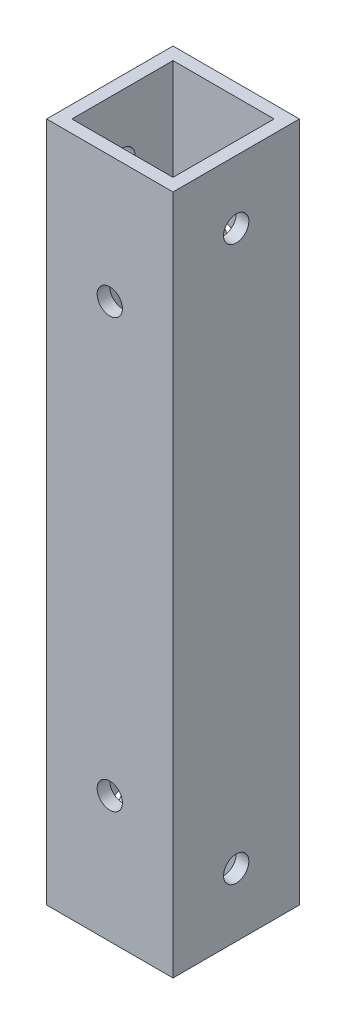
ISO-10303-21;
HEADER;
FILE_DESCRIPTION(('STEP AP214'),'2;1');
FILE_NAME('part.step','',(''),(''),'','','');
FILE_SCHEMA(('AUTOMOTIVE_DESIGN { 1 0 10303 214 1 1 1 1 }'));
ENDSEC;
DATA;
#1=APPLICATION_CONTEXT('core data for automotive mechanical design processes');
#2=APPLICATION_PROTOCOL_DEFINITION('international standard','automotive_design',2000,#1);
#3=PRODUCT_CONTEXT('',#1,'mechanical');
#4=PRODUCT('Part','Part','',(#3));
#5=PRODUCT_RELATED_PRODUCT_CATEGORY('part','',(#4));
#6=PRODUCT_DEFINITION_FORMATION('','',#4);
#7=PRODUCT_DEFINITION_CONTEXT('part definition',#1,'design');
#8=PRODUCT_DEFINITION('design','',#6,#7);
#9=PRODUCT_DEFINITION_SHAPE('','',#8);
#10=(LENGTH_UNIT() NAMED_UNIT(*) SI_UNIT(.MILLI.,.METRE.));
#11=(NAMED_UNIT(*) PLANE_ANGLE_UNIT() SI_UNIT($,.RADIAN.));
#12=(NAMED_UNIT(*) SI_UNIT($,.STERADIAN.) SOLID_ANGLE_UNIT());
#13=UNCERTAINTY_MEASURE_WITH_UNIT(LENGTH_MEASURE(1.E-05),#10,'distance_accuracy_value','');
#14=(GEOMETRIC_REPRESENTATION_CONTEXT(3) GLOBAL_UNCERTAINTY_ASSIGNED_CONTEXT((#13)) GLOBAL_UNIT_ASSIGNED_CONTEXT((#10,
#11,#12)) REPRESENTATION_CONTEXT('',''));
#15=CARTESIAN_POINT('',(0.,0.,0.));
#16=DIRECTION('',(0.,0.,1.));
#17=DIRECTION('',(1.,0.,0.));
#18=AXIS2_PLACEMENT_3D('',#15,#16,#17);
#19=CARTESIAN_POINT('',(0.,80.79,0.));
#20=DIRECTION('',(0.,1.,0.));
#21=DIRECTION('',(0.,0.,1.));
#22=AXIS2_PLACEMENT_3D('',#19,#20,#21);
#23=PLANE('',#22);
#24=DIRECTION('',(0.,0.,1.));
#25=VECTOR('',#24,1.);
#26=CARTESIAN_POINT('',(0.,80.79,0.));
#27=LINE('',#26,#25);
#28=CARTESIAN_POINT('',(0.,80.79,-15.));
#29=VERTEX_POINT('',#28);
#30=CARTESIAN_POINT('',(0.,80.79,0.));
#31=VERTEX_POINT('',#30);
#32=EDGE_CURVE('E186',#29,#31,#27,.T.);
#33=ORIENTED_EDGE('',*,*,#32,.T.);
#34=DIRECTION('',(1.,0.,0.));
#35=VECTOR('',#34,1.);
#36=CARTESIAN_POINT('',(0.,80.79,0.));
#37=LINE('',#36,#35);
#38=CARTESIAN_POINT('',(15.,80.79,0.));
#39=VERTEX_POINT('',#38);
#40=EDGE_CURVE('E190',#31,#39,#37,.T.);
#41=ORIENTED_EDGE('',*,*,#40,.T.);
#42=DIRECTION('',(0.,0.,-1.));
#43=VECTOR('',#42,1.);
#44=CARTESIAN_POINT('',(15.,80.79,0.));
#45=LINE('',#44,#43);
#46=CARTESIAN_POINT('',(15.,80.79,-15.));
#47=VERTEX_POINT('',#46);
#48=EDGE_CURVE('E194',#39,#47,#45,.T.);
#49=ORIENTED_EDGE('',*,*,#48,.T.);
#50=DIRECTION('',(-1.,0.,0.));
#51=VECTOR('',#50,1.);
#52=CARTESIAN_POINT('',(0.,80.79,-15.));
#53=LINE('',#52,#51);
#54=EDGE_CURVE('E197',#47,#29,#53,.T.);
#55=ORIENTED_EDGE('',*,*,#54,.T.);
#56=EDGE_LOOP('',(#33,#41,#49,#55));
#57=FACE_BOUND('',#56,.T.);
#58=DIRECTION('',(1.,0.,0.));
#59=VECTOR('',#58,1.);
#60=CARTESIAN_POINT('',(0.,80.79,-1.5));
#61=LINE('',#60,#59);
#62=CARTESIAN_POINT('',(1.5,80.79,-1.5));
#63=VERTEX_POINT('',#62);
#64=CARTESIAN_POINT('',(13.5,80.79,-1.5));
#65=VERTEX_POINT('',#64);
#66=EDGE_CURVE('E145',#63,#65,#61,.T.);
#67=ORIENTED_EDGE('',*,*,#66,.F.);
#68=DIRECTION('',(0.,0.,1.));
#69=VECTOR('',#68,1.);
#70=CARTESIAN_POINT('',(1.5,80.79,0.));
#71=LINE('',#70,#69);
#72=CARTESIAN_POINT('',(1.5,80.79,-13.5));
#73=VERTEX_POINT('',#72);
#74=EDGE_CURVE('E136',#73,#63,#71,.T.);
#75=ORIENTED_EDGE('',*,*,#74,.F.);
#76=DIRECTION('',(-1.,0.,0.));
#77=VECTOR('',#76,1.);
#78=CARTESIAN_POINT('',(0.,80.79,-13.5));
#79=LINE('',#78,#77);
#80=CARTESIAN_POINT('',(13.5,80.79,-13.5));
#81=VERTEX_POINT('',#80);
#82=EDGE_CURVE('E162',#81,#73,#79,.T.);
#83=ORIENTED_EDGE('',*,*,#82,.F.);
#84=DIRECTION('',(0.,0.,-1.));
#85=VECTOR('',#84,1.);
#86=CARTESIAN_POINT('',(13.5,80.79,0.));
#87=LINE('',#86,#85);
#88=EDGE_CURVE('E158',#65,#81,#87,.T.);
#89=ORIENTED_EDGE('',*,*,#88,.F.);
#90=EDGE_LOOP('',(#67,#75,#83,#89));
#91=FACE_BOUND('',#90,.T.);
#92=ADVANCED_FACE('F68',(#57,#91),#23,.T.);
#93=CARTESIAN_POINT('',(0.,0.,0.));
#94=DIRECTION('',(0.,1.,0.));
#95=DIRECTION('',(0.,0.,1.));
#96=AXIS2_PLACEMENT_3D('',#93,#94,#95);
#97=PLANE('',#96);
#98=DIRECTION('',(0.,0.,1.));
#99=VECTOR('',#98,1.);
#100=CARTESIAN_POINT('',(0.,0.,0.));
#101=LINE('',#100,#99);
#102=CARTESIAN_POINT('',(0.,0.,-15.));
#103=VERTEX_POINT('',#102);
#104=CARTESIAN_POINT('',(0.,0.,0.));
#105=VERTEX_POINT('',#104);
#106=EDGE_CURVE('E154',#103,#105,#101,.T.);
#107=ORIENTED_EDGE('',*,*,#106,.F.);
#108=DIRECTION('',(-1.,0.,0.));
#109=VECTOR('',#108,1.);
#110=CARTESIAN_POINT('',(0.,0.,-15.));
#111=LINE('',#110,#109);
#112=CARTESIAN_POINT('',(15.,0.,-15.));
#113=VERTEX_POINT('',#112);
#114=EDGE_CURVE('E191',#113,#103,#111,.T.);
#115=ORIENTED_EDGE('',*,*,#114,.F.);
#116=DIRECTION('',(0.,0.,-1.));
#117=VECTOR('',#116,1.);
#118=CARTESIAN_POINT('',(15.,0.,0.));
#119=LINE('',#118,#117);
#120=CARTESIAN_POINT('',(15.,0.,0.));
#121=VERTEX_POINT('',#120);
#122=EDGE_CURVE('E207',#121,#113,#119,.T.);
#123=ORIENTED_EDGE('',*,*,#122,.F.);
#124=DIRECTION('',(1.,0.,0.));
#125=VECTOR('',#124,1.);
#126=CARTESIAN_POINT('',(0.,0.,0.));
#127=LINE('',#126,#125);
#128=EDGE_CURVE('E204',#105,#121,#127,.T.);
#129=ORIENTED_EDGE('',*,*,#128,.F.);
#130=EDGE_LOOP('',(#107,#115,#123,#129));
#131=FACE_BOUND('',#130,.T.);
#132=DIRECTION('',(0.,0.,1.));
#133=VECTOR('',#132,1.);
#134=CARTESIAN_POINT('',(1.5,0.,0.));
#135=LINE('',#134,#133);
#136=CARTESIAN_POINT('',(1.5,0.,-13.5));
#137=VERTEX_POINT('',#136);
#138=CARTESIAN_POINT('',(1.5,0.,-1.5));
#139=VERTEX_POINT('',#138);
#140=EDGE_CURVE('E94',#137,#139,#135,.T.);
#141=ORIENTED_EDGE('',*,*,#140,.T.);
#142=DIRECTION('',(1.,0.,0.));
#143=VECTOR('',#142,1.);
#144=CARTESIAN_POINT('',(0.,0.,-1.5));
#145=LINE('',#144,#143);
#146=CARTESIAN_POINT('',(13.5,0.,-1.5));
#147=VERTEX_POINT('',#146);
#148=EDGE_CURVE('E152',#139,#147,#145,.T.);
#149=ORIENTED_EDGE('',*,*,#148,.T.);
#150=DIRECTION('',(0.,0.,-1.));
#151=VECTOR('',#150,1.);
#152=CARTESIAN_POINT('',(13.5,0.,0.));
#153=LINE('',#152,#151);
#154=CARTESIAN_POINT('',(13.5,0.,-13.5));
#155=VERTEX_POINT('',#154);
#156=EDGE_CURVE('E173',#147,#155,#153,.T.);
#157=ORIENTED_EDGE('',*,*,#156,.T.);
#158=DIRECTION('',(-1.,0.,0.));
#159=VECTOR('',#158,1.);
#160=CARTESIAN_POINT('',(0.,0.,-13.5));
#161=LINE('',#160,#159);
#162=EDGE_CURVE('E146',#155,#137,#161,.T.);
#163=ORIENTED_EDGE('',*,*,#162,.T.);
#164=EDGE_LOOP('',(#141,#149,#157,#163));
#165=FACE_BOUND('',#164,.T.);
#166=ADVANCED_FACE('F304',(#131,#165),#97,.F.);
#167=CARTESIAN_POINT('',(0.,80.79,0.));
#168=DIRECTION('',(1.,0.,0.));
#169=DIRECTION('',(0.,0.,-1.));
#170=AXIS2_PLACEMENT_3D('',#167,#168,#169);
#171=PLANE('',#170);
#172=CARTESIAN_POINT('',(0.,7.50126422701704,-7.5));
#173=DIRECTION('',(-1.,0.,0.));
#174=DIRECTION('',(0.,0.,1.));
#175=AXIS2_PLACEMENT_3D('',#172,#173,#174);
#176=CIRCLE('',#175,1.5);
#177=CARTESIAN_POINT('',(0.,7.50126422701704,-6.));
#178=VERTEX_POINT('',#177);
#179=EDGE_CURVE('E267',#178,#178,#176,.T.);
#180=ORIENTED_EDGE('',*,*,#179,.F.);
#181=EDGE_LOOP('',(#180));
#182=FACE_BOUND('',#181,.T.);
#183=CARTESIAN_POINT('',(0.,73.291264227017,-7.5));
#184=DIRECTION('',(-1.,0.,0.));
#185=DIRECTION('',(0.,0.,1.));
#186=AXIS2_PLACEMENT_3D('',#183,#184,#185);
#187=CIRCLE('',#186,1.5);
#188=CARTESIAN_POINT('',(0.,73.291264227017,-6.));
#189=VERTEX_POINT('',#188);
#190=EDGE_CURVE('E271',#189,#189,#187,.T.);
#191=ORIENTED_EDGE('',*,*,#190,.F.);
#192=EDGE_LOOP('',(#191));
#193=FACE_BOUND('',#192,.T.);
#194=ORIENTED_EDGE('',*,*,#106,.T.);
#195=DIRECTION('',(0.,-1.,0.));
#196=VECTOR('',#195,1.);
#197=CARTESIAN_POINT('',(0.,80.79,0.));
#198=LINE('',#197,#196);
#199=EDGE_CURVE('E12',#31,#105,#198,.T.);
#200=ORIENTED_EDGE('',*,*,#199,.F.);
#201=ORIENTED_EDGE('',*,*,#32,.F.);
#202=DIRECTION('',(0.,-1.,0.));
#203=VECTOR('',#202,1.);
#204=CARTESIAN_POINT('',(0.,80.79,-15.));
#205=LINE('',#204,#203);
#206=EDGE_CURVE('E200',#29,#103,#205,.T.);
#207=ORIENTED_EDGE('',*,*,#206,.T.);
#208=EDGE_LOOP('',(#194,#200,#201,#207));
#209=FACE_BOUND('',#208,.T.);
#210=ADVANCED_FACE('F70',(#182,#193,#209),#171,.F.);
#211=CARTESIAN_POINT('',(0.,80.79,0.));
#212=DIRECTION('',(0.,0.,-1.));
#213=DIRECTION('',(-1.,0.,0.));
#214=AXIS2_PLACEMENT_3D('',#211,#212,#213);
#215=PLANE('',#214);
#216=CARTESIAN_POINT('',(7.5,15.,0.));
#217=DIRECTION('',(0.,0.,1.));
#218=DIRECTION('',(1.,0.,0.));
#219=AXIS2_PLACEMENT_3D('',#216,#217,#218);
#220=CIRCLE('',#219,1.5);
#221=CARTESIAN_POINT('',(9.,15.,0.));
#222=VERTEX_POINT('',#221);
#223=EDGE_CURVE('E243',#222,#222,#220,.T.);
#224=ORIENTED_EDGE('',*,*,#223,.F.);
#225=EDGE_LOOP('',(#224));
#226=FACE_BOUND('',#225,.T.);
#227=CARTESIAN_POINT('',(7.5,65.79,0.));
#228=DIRECTION('',(0.,0.,1.));
#229=DIRECTION('',(-1.,0.,0.));
#230=AXIS2_PLACEMENT_3D('',#227,#228,#229);
#231=CIRCLE('',#230,1.5);
#232=CARTESIAN_POINT('',(6.,65.79,0.));
#233=VERTEX_POINT('',#232);
#234=EDGE_CURVE('E249',#233,#233,#231,.T.);
#235=ORIENTED_EDGE('',*,*,#234,.F.);
#236=EDGE_LOOP('',(#235));
#237=FACE_BOUND('',#236,.T.);
#238=ORIENTED_EDGE('',*,*,#128,.T.);
#239=DIRECTION('',(0.,-1.,0.));
#240=VECTOR('',#239,1.);
#241=CARTESIAN_POINT('',(15.,80.79,0.));
#242=LINE('',#241,#240);
#243=EDGE_CURVE('E78',#39,#121,#242,.T.);
#244=ORIENTED_EDGE('',*,*,#243,.F.);
#245=ORIENTED_EDGE('',*,*,#40,.F.);
#246=ORIENTED_EDGE('',*,*,#199,.T.);
#247=EDGE_LOOP('',(#238,#244,#245,#246));
#248=FACE_BOUND('',#247,.T.);
#249=ADVANCED_FACE('F303',(#226,#237,#248),#215,.F.);
#250=CARTESIAN_POINT('',(15.,80.79,0.));
#251=DIRECTION('',(-1.,0.,0.));
#252=DIRECTION('',(0.,0.,1.));
#253=AXIS2_PLACEMENT_3D('',#250,#251,#252);
#254=PLANE('',#253);
#255=CARTESIAN_POINT('',(15.,7.50126422701704,-7.5));
#256=DIRECTION('',(-1.,0.,0.));
#257=DIRECTION('',(0.,0.,1.));
#258=AXIS2_PLACEMENT_3D('',#255,#256,#257);
#259=CIRCLE('',#258,1.5);
#260=CARTESIAN_POINT('',(15.,7.50126422701704,-6.));
#261=VERTEX_POINT('',#260);
#262=EDGE_CURVE('E227',#261,#261,#259,.T.);
#263=ORIENTED_EDGE('',*,*,#262,.T.);
#264=EDGE_LOOP('',(#263));
#265=FACE_BOUND('',#264,.T.);
#266=CARTESIAN_POINT('',(15.,73.291264227017,-7.5));
#267=DIRECTION('',(-1.,0.,0.));
#268=DIRECTION('',(0.,0.,1.));
#269=AXIS2_PLACEMENT_3D('',#266,#267,#268);
#270=CIRCLE('',#269,1.5);
#271=CARTESIAN_POINT('',(15.,73.291264227017,-6.));
#272=VERTEX_POINT('',#271);
#273=EDGE_CURVE('E263',#272,#272,#270,.T.);
#274=ORIENTED_EDGE('',*,*,#273,.T.);
#275=EDGE_LOOP('',(#274));
#276=FACE_BOUND('',#275,.T.);
#277=ORIENTED_EDGE('',*,*,#122,.T.);
#278=DIRECTION('',(0.,-1.,0.));
#279=VECTOR('',#278,1.);
#280=CARTESIAN_POINT('',(15.,80.79,-15.));
#281=LINE('',#280,#279);
#282=EDGE_CURVE('E215',#47,#113,#281,.T.);
#283=ORIENTED_EDGE('',*,*,#282,.F.);
#284=ORIENTED_EDGE('',*,*,#48,.F.);
#285=ORIENTED_EDGE('',*,*,#243,.T.);
#286=EDGE_LOOP('',(#277,#283,#284,#285));
#287=FACE_BOUND('',#286,.T.);
#288=ADVANCED_FACE('F322',(#265,#276,#287),#254,.F.);
#289=CARTESIAN_POINT('',(0.,80.79,-15.));
#290=DIRECTION('',(0.,0.,1.));
#291=DIRECTION('',(1.,0.,0.));
#292=AXIS2_PLACEMENT_3D('',#289,#290,#291);
#293=PLANE('',#292);
#294=CARTESIAN_POINT('',(7.5,15.,-15.));
#295=DIRECTION('',(0.,0.,1.));
#296=DIRECTION('',(1.,0.,0.));
#297=AXIS2_PLACEMENT_3D('',#294,#295,#296);
#298=CIRCLE('',#297,1.5);
#299=CARTESIAN_POINT('',(9.,15.,-15.));
#300=VERTEX_POINT('',#299);
#301=EDGE_CURVE('E235',#300,#300,#298,.T.);
#302=ORIENTED_EDGE('',*,*,#301,.T.);
#303=EDGE_LOOP('',(#302));
#304=FACE_BOUND('',#303,.T.);
#305=CARTESIAN_POINT('',(7.5,65.79,-15.));
#306=DIRECTION('',(0.,0.,1.));
#307=DIRECTION('',(-1.,0.,0.));
#308=AXIS2_PLACEMENT_3D('',#305,#306,#307);
#309=CIRCLE('',#308,1.5);
#310=CARTESIAN_POINT('',(6.,65.79,-15.));
#311=VERTEX_POINT('',#310);
#312=EDGE_CURVE('E255',#311,#311,#309,.T.);
#313=ORIENTED_EDGE('',*,*,#312,.T.);
#314=EDGE_LOOP('',(#313));
#315=FACE_BOUND('',#314,.T.);
#316=ORIENTED_EDGE('',*,*,#114,.T.);
#317=ORIENTED_EDGE('',*,*,#206,.F.);
#318=ORIENTED_EDGE('',*,*,#54,.F.);
#319=ORIENTED_EDGE('',*,*,#282,.T.);
#320=EDGE_LOOP('',(#316,#317,#318,#319));
#321=FACE_BOUND('',#320,.T.);
#322=ADVANCED_FACE('F289',(#304,#315,#321),#293,.F.);
#323=CARTESIAN_POINT('',(1.5,80.79,0.));
#324=DIRECTION('',(1.,0.,0.));
#325=DIRECTION('',(0.,0.,-1.));
#326=AXIS2_PLACEMENT_3D('',#323,#324,#325);
#327=PLANE('',#326);
#328=CARTESIAN_POINT('',(1.5,7.50126422701704,-7.5));
#329=DIRECTION('',(1.,0.,0.));
#330=DIRECTION('',(0.,0.,-1.));
#331=AXIS2_PLACEMENT_3D('',#328,#329,#330);
#332=CIRCLE('',#331,1.5);
#333=CARTESIAN_POINT('',(1.5,7.50126422701704,-9.));
#334=VERTEX_POINT('',#333);
#335=EDGE_CURVE('E170',#334,#334,#332,.T.);
#336=ORIENTED_EDGE('',*,*,#335,.F.);
#337=EDGE_LOOP('',(#336));
#338=FACE_BOUND('',#337,.T.);
#339=CARTESIAN_POINT('',(1.5,73.291264227017,-7.5));
#340=DIRECTION('',(1.,0.,0.));
#341=DIRECTION('',(0.,0.,-1.));
#342=AXIS2_PLACEMENT_3D('',#339,#340,#341);
#343=CIRCLE('',#342,1.5);
#344=CARTESIAN_POINT('',(1.5,73.291264227017,-9.));
#345=VERTEX_POINT('',#344);
#346=EDGE_CURVE('E226',#345,#345,#343,.T.);
#347=ORIENTED_EDGE('',*,*,#346,.F.);
#348=EDGE_LOOP('',(#347));
#349=FACE_BOUND('',#348,.T.);
#350=ORIENTED_EDGE('',*,*,#140,.F.);
#351=DIRECTION('',(0.,-1.,0.));
#352=VECTOR('',#351,1.);
#353=CARTESIAN_POINT('',(1.5,80.79,-13.5));
#354=LINE('',#353,#352);
#355=EDGE_CURVE('E140',#73,#137,#354,.T.);
#356=ORIENTED_EDGE('',*,*,#355,.F.);
#357=ORIENTED_EDGE('',*,*,#74,.T.);
#358=DIRECTION('',(0.,-1.,0.));
#359=VECTOR('',#358,1.);
#360=CARTESIAN_POINT('',(1.5,80.79,-1.5));
#361=LINE('',#360,#359);
#362=EDGE_CURVE('E139',#63,#139,#361,.T.);
#363=ORIENTED_EDGE('',*,*,#362,.T.);
#364=EDGE_LOOP('',(#350,#356,#357,#363));
#365=FACE_BOUND('',#364,.T.);
#366=ADVANCED_FACE('F138',(#338,#349,#365),#327,.T.);
#367=CARTESIAN_POINT('',(0.,80.79,-1.5));
#368=DIRECTION('',(0.,0.,-1.));
#369=DIRECTION('',(-1.,0.,0.));
#370=AXIS2_PLACEMENT_3D('',#367,#368,#369);
#371=PLANE('',#370);
#372=CARTESIAN_POINT('',(7.5,15.,-1.5));
#373=DIRECTION('',(0.,0.,-1.));
#374=DIRECTION('',(-1.,0.,0.));
#375=AXIS2_PLACEMENT_3D('',#372,#373,#374);
#376=CIRCLE('',#375,1.5);
#377=CARTESIAN_POINT('',(6.,15.,-1.5));
#378=VERTEX_POINT('',#377);
#379=EDGE_CURVE('E259',#378,#378,#376,.T.);
#380=ORIENTED_EDGE('',*,*,#379,.F.);
#381=EDGE_LOOP('',(#380));
#382=FACE_BOUND('',#381,.T.);
#383=CARTESIAN_POINT('',(7.5,65.79,-1.5));
#384=DIRECTION('',(0.,0.,-1.));
#385=DIRECTION('',(-1.,0.,0.));
#386=AXIS2_PLACEMENT_3D('',#383,#384,#385);
#387=CIRCLE('',#386,1.5);
#388=CARTESIAN_POINT('',(6.,65.79,-1.5));
#389=VERTEX_POINT('',#388);
#390=EDGE_CURVE('E234',#389,#389,#387,.T.);
#391=ORIENTED_EDGE('',*,*,#390,.F.);
#392=EDGE_LOOP('',(#391));
#393=FACE_BOUND('',#392,.T.);
#394=ORIENTED_EDGE('',*,*,#148,.F.);
#395=ORIENTED_EDGE('',*,*,#362,.F.);
#396=ORIENTED_EDGE('',*,*,#66,.T.);
#397=DIRECTION('',(0.,-1.,0.));
#398=VECTOR('',#397,1.);
#399=CARTESIAN_POINT('',(13.5,80.79,-1.5));
#400=LINE('',#399,#398);
#401=EDGE_CURVE('E155',#65,#147,#400,.T.);
#402=ORIENTED_EDGE('',*,*,#401,.T.);
#403=EDGE_LOOP('',(#394,#395,#396,#402));
#404=FACE_BOUND('',#403,.T.);
#405=ADVANCED_FACE('F149',(#382,#393,#404),#371,.T.);
#406=CARTESIAN_POINT('',(13.5,80.79,0.));
#407=DIRECTION('',(-1.,0.,0.));
#408=DIRECTION('',(0.,0.,1.));
#409=AXIS2_PLACEMENT_3D('',#406,#407,#408);
#410=PLANE('',#409);
#411=CARTESIAN_POINT('',(13.5,7.50126422701704,-7.5));
#412=DIRECTION('',(-1.,0.,0.));
#413=DIRECTION('',(0.,0.,1.));
#414=AXIS2_PLACEMENT_3D('',#411,#412,#413);
#415=CIRCLE('',#414,1.5);
#416=CARTESIAN_POINT('',(13.5,7.50126422701704,-6.));
#417=VERTEX_POINT('',#416);
#418=EDGE_CURVE('E228',#417,#417,#415,.T.);
#419=ORIENTED_EDGE('',*,*,#418,.F.);
#420=EDGE_LOOP('',(#419));
#421=FACE_BOUND('',#420,.T.);
#422=CARTESIAN_POINT('',(13.5,73.291264227017,-7.5));
#423=DIRECTION('',(-1.,0.,0.));
#424=DIRECTION('',(0.,0.,1.));
#425=AXIS2_PLACEMENT_3D('',#422,#423,#424);
#426=CIRCLE('',#425,1.5);
#427=CARTESIAN_POINT('',(13.5,73.291264227017,-6.));
#428=VERTEX_POINT('',#427);
#429=EDGE_CURVE('E222',#428,#428,#426,.T.);
#430=ORIENTED_EDGE('',*,*,#429,.F.);
#431=EDGE_LOOP('',(#430));
#432=FACE_BOUND('',#431,.T.);
#433=ORIENTED_EDGE('',*,*,#156,.F.);
#434=ORIENTED_EDGE('',*,*,#401,.F.);
#435=ORIENTED_EDGE('',*,*,#88,.T.);
#436=DIRECTION('',(0.,-1.,0.));
#437=VECTOR('',#436,1.);
#438=CARTESIAN_POINT('',(13.5,80.79,-13.5));
#439=LINE('',#438,#437);
#440=EDGE_CURVE('E86',#81,#155,#439,.T.);
#441=ORIENTED_EDGE('',*,*,#440,.T.);
#442=EDGE_LOOP('',(#433,#434,#435,#441));
#443=FACE_BOUND('',#442,.T.);
#444=ADVANCED_FACE('F342',(#421,#432,#443),#410,.T.);
#445=CARTESIAN_POINT('',(0.,80.79,-13.5));
#446=DIRECTION('',(0.,0.,1.));
#447=DIRECTION('',(1.,0.,0.));
#448=AXIS2_PLACEMENT_3D('',#445,#446,#447);
#449=PLANE('',#448);
#450=CARTESIAN_POINT('',(7.5,15.,-13.5));
#451=DIRECTION('',(0.,0.,1.));
#452=DIRECTION('',(1.,0.,0.));
#453=AXIS2_PLACEMENT_3D('',#450,#451,#452);
#454=CIRCLE('',#453,1.5);
#455=CARTESIAN_POINT('',(9.,15.,-13.5));
#456=VERTEX_POINT('',#455);
#457=EDGE_CURVE('E72',#456,#456,#454,.T.);
#458=ORIENTED_EDGE('',*,*,#457,.F.);
#459=EDGE_LOOP('',(#458));
#460=FACE_BOUND('',#459,.T.);
#461=CARTESIAN_POINT('',(7.5,65.79,-13.5));
#462=DIRECTION('',(0.,0.,1.));
#463=DIRECTION('',(1.,0.,0.));
#464=AXIS2_PLACEMENT_3D('',#461,#462,#463);
#465=CIRCLE('',#464,1.5);
#466=CARTESIAN_POINT('',(9.,65.79,-13.5));
#467=VERTEX_POINT('',#466);
#468=EDGE_CURVE('E231',#467,#467,#465,.T.);
#469=ORIENTED_EDGE('',*,*,#468,.F.);
#470=EDGE_LOOP('',(#469));
#471=FACE_BOUND('',#470,.T.);
#472=ORIENTED_EDGE('',*,*,#162,.F.);
#473=ORIENTED_EDGE('',*,*,#440,.F.);
#474=ORIENTED_EDGE('',*,*,#82,.T.);
#475=ORIENTED_EDGE('',*,*,#355,.T.);
#476=EDGE_LOOP('',(#472,#473,#474,#475));
#477=FACE_BOUND('',#476,.T.);
#478=ADVANCED_FACE('F346',(#460,#471,#477),#449,.T.);
#479=CARTESIAN_POINT('',(15.,73.291264227017,-7.5));
#480=DIRECTION('',(-1.,0.,0.));
#481=DIRECTION('',(0.,0.,1.));
#482=AXIS2_PLACEMENT_3D('',#479,#480,#481);
#483=CYLINDRICAL_SURFACE('',#482,1.5);
#484=ORIENTED_EDGE('',*,*,#429,.T.);
#485=EDGE_LOOP('',(#484));
#486=FACE_BOUND('',#485,.T.);
#487=ORIENTED_EDGE('',*,*,#273,.F.);
#488=EDGE_LOOP('',(#487));
#489=FACE_BOUND('',#488,.T.);
#490=ADVANCED_FACE('F298',(#486,#489),#483,.F.);
#491=CARTESIAN_POINT('',(15.,7.50126422701704,-7.5));
#492=DIRECTION('',(-1.,0.,0.));
#493=DIRECTION('',(0.,0.,1.));
#494=AXIS2_PLACEMENT_3D('',#491,#492,#493);
#495=CYLINDRICAL_SURFACE('',#494,1.5);
#496=ORIENTED_EDGE('',*,*,#418,.T.);
#497=EDGE_LOOP('',(#496));
#498=FACE_BOUND('',#497,.T.);
#499=ORIENTED_EDGE('',*,*,#262,.F.);
#500=EDGE_LOOP('',(#499));
#501=FACE_BOUND('',#500,.T.);
#502=ADVANCED_FACE('F296',(#498,#501),#495,.F.);
#503=ORIENTED_EDGE('',*,*,#346,.T.);
#504=EDGE_LOOP('',(#503));
#505=FACE_BOUND('',#504,.T.);
#506=ORIENTED_EDGE('',*,*,#190,.T.);
#507=EDGE_LOOP('',(#506));
#508=FACE_BOUND('',#507,.T.);
#509=ADVANCED_FACE('F293',(#505,#508),#483,.F.);
#510=ORIENTED_EDGE('',*,*,#335,.T.);
#511=EDGE_LOOP('',(#510));
#512=FACE_BOUND('',#511,.T.);
#513=ORIENTED_EDGE('',*,*,#179,.T.);
#514=EDGE_LOOP('',(#513));
#515=FACE_BOUND('',#514,.T.);
#516=ADVANCED_FACE('F284',(#512,#515),#495,.F.);
#517=CARTESIAN_POINT('',(7.5,65.79,-15.));
#518=DIRECTION('',(0.,0.,1.));
#519=DIRECTION('',(1.,0.,0.));
#520=AXIS2_PLACEMENT_3D('',#517,#518,#519);
#521=CYLINDRICAL_SURFACE('',#520,1.5);
#522=ORIENTED_EDGE('',*,*,#468,.T.);
#523=EDGE_LOOP('',(#522));
#524=FACE_BOUND('',#523,.T.);
#525=ORIENTED_EDGE('',*,*,#312,.F.);
#526=EDGE_LOOP('',(#525));
#527=FACE_BOUND('',#526,.T.);
#528=ADVANCED_FACE('F356',(#524,#527),#521,.F.);
#529=CARTESIAN_POINT('',(7.5,15.,-15.));
#530=DIRECTION('',(0.,0.,1.));
#531=DIRECTION('',(1.,0.,0.));
#532=AXIS2_PLACEMENT_3D('',#529,#530,#531);
#533=CYLINDRICAL_SURFACE('',#532,1.5);
#534=ORIENTED_EDGE('',*,*,#457,.T.);
#535=EDGE_LOOP('',(#534));
#536=FACE_BOUND('',#535,.T.);
#537=ORIENTED_EDGE('',*,*,#301,.F.);
#538=EDGE_LOOP('',(#537));
#539=FACE_BOUND('',#538,.T.);
#540=ADVANCED_FACE('F359',(#536,#539),#533,.F.);
#541=ORIENTED_EDGE('',*,*,#390,.T.);
#542=EDGE_LOOP('',(#541));
#543=FACE_BOUND('',#542,.T.);
#544=ORIENTED_EDGE('',*,*,#234,.T.);
#545=EDGE_LOOP('',(#544));
#546=FACE_BOUND('',#545,.T.);
#547=ADVANCED_FACE('F360',(#543,#546),#521,.F.);
#548=ORIENTED_EDGE('',*,*,#379,.T.);
#549=EDGE_LOOP('',(#548));
#550=FACE_BOUND('',#549,.T.);
#551=ORIENTED_EDGE('',*,*,#223,.T.);
#552=EDGE_LOOP('',(#551));
#553=FACE_BOUND('',#552,.T.);
#554=ADVANCED_FACE('F363',(#550,#553),#533,.F.);
#555=CLOSED_SHELL('',(#92,#166,#210,#249,#288,#322,#366,#405,#444,#478,#490,#502,#509,#516,#528,
#540,#547,#554));
#556=MANIFOLD_SOLID_BREP('B2',#555);
#557=ADVANCED_BREP_SHAPE_REPRESENTATION('',(#18,#556),#14);
#558=SHAPE_DEFINITION_REPRESENTATION(#9,#557);
ENDSEC;
END-ISO-10303-21;
